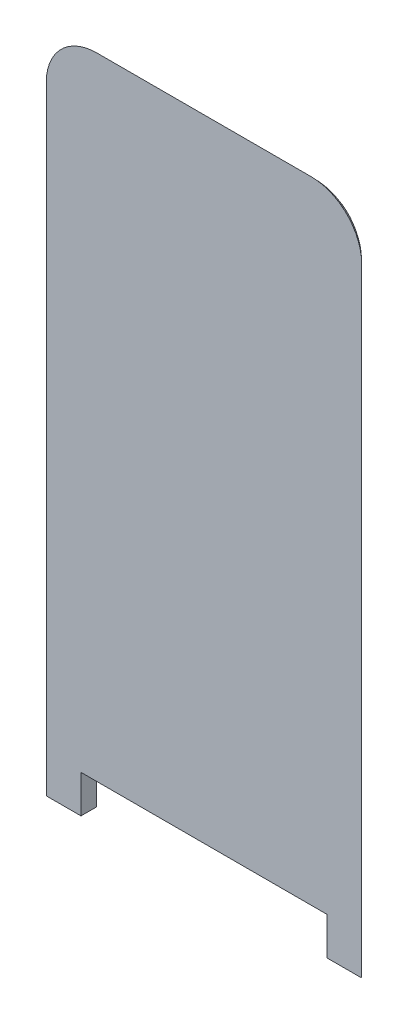
ISO-10303-21;
HEADER;
FILE_DESCRIPTION(('STEP AP214'),'2;1');
FILE_NAME('part.step','',(''),(''),'','','');
FILE_SCHEMA(('AUTOMOTIVE_DESIGN { 1 0 10303 214 1 1 1 1 }'));
ENDSEC;
DATA;
#1=APPLICATION_CONTEXT('core data for automotive mechanical design processes');
#2=APPLICATION_PROTOCOL_DEFINITION('international standard','automotive_design',2000,#1);
#3=PRODUCT_CONTEXT('',#1,'mechanical');
#4=PRODUCT('Part','Part','',(#3));
#5=PRODUCT_RELATED_PRODUCT_CATEGORY('part','',(#4));
#6=PRODUCT_DEFINITION_FORMATION('','',#4);
#7=PRODUCT_DEFINITION_CONTEXT('part definition',#1,'design');
#8=PRODUCT_DEFINITION('design','',#6,#7);
#9=PRODUCT_DEFINITION_SHAPE('','',#8);
#10=(LENGTH_UNIT() NAMED_UNIT(*) SI_UNIT(.MILLI.,.METRE.));
#11=(NAMED_UNIT(*) PLANE_ANGLE_UNIT() SI_UNIT($,.RADIAN.));
#12=(NAMED_UNIT(*) SI_UNIT($,.STERADIAN.) SOLID_ANGLE_UNIT());
#13=UNCERTAINTY_MEASURE_WITH_UNIT(LENGTH_MEASURE(1.E-05),#10,'distance_accuracy_value','');
#14=(GEOMETRIC_REPRESENTATION_CONTEXT(3) GLOBAL_UNCERTAINTY_ASSIGNED_CONTEXT((#13)) GLOBAL_UNIT_ASSIGNED_CONTEXT((#10,
#11,#12)) REPRESENTATION_CONTEXT('',''));
#15=CARTESIAN_POINT('',(0.,0.,0.));
#16=DIRECTION('',(0.,0.,1.));
#17=DIRECTION('',(1.,0.,0.));
#18=AXIS2_PLACEMENT_3D('',#15,#16,#17);
#19=CARTESIAN_POINT('',(-25.,-53.,2.5));
#20=DIRECTION('',(0.,1.,0.));
#21=DIRECTION('',(0.,0.,1.));
#22=AXIS2_PLACEMENT_3D('',#19,#20,#21);
#23=PLANE('',#22);
#24=DIRECTION('',(1.,0.,0.));
#25=VECTOR('',#24,1.);
#26=CARTESIAN_POINT('',(-25.,-53.,2.5));
#27=LINE('',#26,#25);
#28=CARTESIAN_POINT('',(-25.,-53.,2.5));
#29=VERTEX_POINT('',#28);
#30=CARTESIAN_POINT('',(-19.5,-53.,2.5));
#31=VERTEX_POINT('',#30);
#32=EDGE_CURVE('E129',#29,#31,#27,.T.);
#33=ORIENTED_EDGE('',*,*,#32,.F.);
#34=CARTESIAN_POINT('',(-19.1905249806889,-53.,8.));
#35=DIRECTION('',(0.,1.,0.));
#36=DIRECTION('',(0.,0.,1.));
#37=AXIS2_PLACEMENT_3D('',#34,#35,#36);
#38=CIRCLE('',#37,8.);
#39=CARTESIAN_POINT('',(-19.5,-53.,0.00598816535637287));
#40=VERTEX_POINT('',#39);
#41=EDGE_CURVE('E114',#29,#40,#38,.F.);
#42=ORIENTED_EDGE('',*,*,#41,.T.);
#43=DIRECTION('',(0.,0.,-1.));
#44=VECTOR('',#43,1.);
#45=CARTESIAN_POINT('',(-19.5,-53.,2.5));
#46=LINE('',#45,#44);
#47=EDGE_CURVE('E135',#31,#40,#46,.T.);
#48=ORIENTED_EDGE('',*,*,#47,.F.);
#49=EDGE_LOOP('',(#33,#42,#48));
#50=FACE_BOUND('',#49,.T.);
#51=ADVANCED_FACE('F34',(#50),#23,.F.);
#52=CARTESIAN_POINT('',(-19.5,-53.,2.5));
#53=DIRECTION('',(-1.,0.,0.));
#54=DIRECTION('',(0.,0.,1.));
#55=AXIS2_PLACEMENT_3D('',#52,#53,#54);
#56=PLANE('',#55);
#57=ORIENTED_EDGE('',*,*,#47,.T.);
#58=DIRECTION('',(0.,-1.,0.));
#59=VECTOR('',#58,1.);
#60=CARTESIAN_POINT('',(-19.5,-53.,0.00598816535637287));
#61=LINE('',#60,#59);
#62=CARTESIAN_POINT('',(-19.5,-47.017253965727,0.00598816535637287));
#63=VERTEX_POINT('',#62);
#64=EDGE_CURVE('E120',#40,#63,#61,.F.);
#65=ORIENTED_EDGE('',*,*,#64,.T.);
#66=DIRECTION('',(0.,0.,-1.));
#67=VECTOR('',#66,1.);
#68=CARTESIAN_POINT('',(-19.5,-47.017253965727,2.5));
#69=LINE('',#68,#67);
#70=CARTESIAN_POINT('',(-19.5,-47.017253965727,2.5));
#71=VERTEX_POINT('',#70);
#72=EDGE_CURVE('E157',#71,#63,#69,.T.);
#73=ORIENTED_EDGE('',*,*,#72,.F.);
#74=DIRECTION('',(0.,1.,0.));
#75=VECTOR('',#74,1.);
#76=CARTESIAN_POINT('',(-19.5,-53.,2.5));
#77=LINE('',#76,#75);
#78=EDGE_CURVE('E137',#31,#71,#77,.T.);
#79=ORIENTED_EDGE('',*,*,#78,.F.);
#80=EDGE_LOOP('',(#57,#65,#73,#79));
#81=FACE_BOUND('',#80,.T.);
#82=ADVANCED_FACE('F216',(#81),#56,.F.);
#83=CARTESIAN_POINT('',(-19.5,-47.017253965727,2.5));
#84=DIRECTION('',(0.,1.,0.));
#85=DIRECTION('',(0.,0.,1.));
#86=AXIS2_PLACEMENT_3D('',#83,#84,#85);
#87=PLANE('',#86);
#88=ORIENTED_EDGE('',*,*,#72,.T.);
#89=CARTESIAN_POINT('',(-19.1905249806889,-47.017253965727,8.));
#90=DIRECTION('',(0.,1.,0.));
#91=DIRECTION('',(0.,0.,1.));
#92=AXIS2_PLACEMENT_3D('',#89,#90,#91);
#93=CIRCLE('',#92,8.);
#94=CARTESIAN_POINT('',(-19.1905249806889,-47.017253965727,0.));
#95=VERTEX_POINT('',#94);
#96=EDGE_CURVE('E166',#63,#95,#93,.F.);
#97=ORIENTED_EDGE('',*,*,#96,.T.);
#98=DIRECTION('',(1.,0.,0.));
#99=VECTOR('',#98,1.);
#100=CARTESIAN_POINT('',(-19.5,-47.017253965727,0.));
#101=LINE('',#100,#99);
#102=CARTESIAN_POINT('',(19.1905249806889,-47.017253965727,0.));
#103=VERTEX_POINT('',#102);
#104=EDGE_CURVE('E150',#95,#103,#101,.T.);
#105=ORIENTED_EDGE('',*,*,#104,.T.);
#106=CARTESIAN_POINT('',(19.1905249806889,-47.017253965727,8.));
#107=DIRECTION('',(0.,1.,0.));
#108=DIRECTION('',(0.,0.,1.));
#109=AXIS2_PLACEMENT_3D('',#106,#107,#108);
#110=CIRCLE('',#109,8.);
#111=CARTESIAN_POINT('',(19.5,-47.017253965727,0.00598816535637287));
#112=VERTEX_POINT('',#111);
#113=EDGE_CURVE('E164',#103,#112,#110,.F.);
#114=ORIENTED_EDGE('',*,*,#113,.T.);
#115=DIRECTION('',(0.,0.,-1.));
#116=VECTOR('',#115,1.);
#117=CARTESIAN_POINT('',(19.5,-47.017253965727,2.5));
#118=LINE('',#117,#116);
#119=CARTESIAN_POINT('',(19.5,-47.017253965727,2.5));
#120=VERTEX_POINT('',#119);
#121=EDGE_CURVE('E155',#120,#112,#118,.T.);
#122=ORIENTED_EDGE('',*,*,#121,.F.);
#123=DIRECTION('',(1.,0.,0.));
#124=VECTOR('',#123,1.);
#125=CARTESIAN_POINT('',(-19.5,-47.017253965727,2.5));
#126=LINE('',#125,#124);
#127=EDGE_CURVE('E139',#71,#120,#126,.T.);
#128=ORIENTED_EDGE('',*,*,#127,.F.);
#129=EDGE_LOOP('',(#88,#97,#105,#114,#122,#128));
#130=FACE_BOUND('',#129,.T.);
#131=ADVANCED_FACE('F201',(#130),#87,.F.);
#132=CARTESIAN_POINT('',(19.5,-53.,2.5));
#133=DIRECTION('',(1.,0.,0.));
#134=DIRECTION('',(0.,0.,-1.));
#135=AXIS2_PLACEMENT_3D('',#132,#133,#134);
#136=PLANE('',#135);
#137=ORIENTED_EDGE('',*,*,#121,.T.);
#138=DIRECTION('',(0.,1.,0.));
#139=VECTOR('',#138,1.);
#140=CARTESIAN_POINT('',(19.5,-47.017253965727,0.00598816535637287));
#141=LINE('',#140,#139);
#142=CARTESIAN_POINT('',(19.5,-53.,0.00598816535637287));
#143=VERTEX_POINT('',#142);
#144=EDGE_CURVE('E43',#112,#143,#141,.F.);
#145=ORIENTED_EDGE('',*,*,#144,.T.);
#146=DIRECTION('',(0.,0.,-1.));
#147=VECTOR('',#146,1.);
#148=CARTESIAN_POINT('',(19.5,-53.,2.5));
#149=LINE('',#148,#147);
#150=CARTESIAN_POINT('',(19.5,-53.,2.5));
#151=VERTEX_POINT('',#150);
#152=EDGE_CURVE('E149',#151,#143,#149,.T.);
#153=ORIENTED_EDGE('',*,*,#152,.F.);
#154=DIRECTION('',(0.,-1.,0.));
#155=VECTOR('',#154,1.);
#156=CARTESIAN_POINT('',(19.5,-53.,2.5));
#157=LINE('',#156,#155);
#158=EDGE_CURVE('E144',#120,#151,#157,.T.);
#159=ORIENTED_EDGE('',*,*,#158,.F.);
#160=EDGE_LOOP('',(#137,#145,#153,#159));
#161=FACE_BOUND('',#160,.T.);
#162=ADVANCED_FACE('F214',(#161),#136,.F.);
#163=CARTESIAN_POINT('',(19.5,-53.,2.5));
#164=DIRECTION('',(0.,1.,0.));
#165=DIRECTION('',(0.,0.,1.));
#166=AXIS2_PLACEMENT_3D('',#163,#164,#165);
#167=PLANE('',#166);
#168=ORIENTED_EDGE('',*,*,#152,.T.);
#169=CARTESIAN_POINT('',(19.1905249806889,-53.,8.));
#170=DIRECTION('',(0.,1.,0.));
#171=DIRECTION('',(0.,0.,1.));
#172=AXIS2_PLACEMENT_3D('',#169,#170,#171);
#173=CIRCLE('',#172,8.);
#174=CARTESIAN_POINT('',(25.,-53.,2.5));
#175=VERTEX_POINT('',#174);
#176=EDGE_CURVE('E11',#143,#175,#173,.F.);
#177=ORIENTED_EDGE('',*,*,#176,.T.);
#178=DIRECTION('',(1.,0.,0.));
#179=VECTOR('',#178,1.);
#180=CARTESIAN_POINT('',(19.5,-53.,2.5));
#181=LINE('',#180,#179);
#182=EDGE_CURVE('E146',#151,#175,#181,.T.);
#183=ORIENTED_EDGE('',*,*,#182,.F.);
#184=EDGE_LOOP('',(#168,#177,#183));
#185=FACE_BOUND('',#184,.T.);
#186=ADVANCED_FACE('F213',(#185),#167,.F.);
#187=CARTESIAN_POINT('',(0.,0.,2.5));
#188=DIRECTION('',(0.,0.,1.));
#189=DIRECTION('',(1.,0.,0.));
#190=AXIS2_PLACEMENT_3D('',#187,#188,#189);
#191=PLANE('',#190);
#192=DIRECTION('',(0.,1.,0.));
#193=VECTOR('',#192,1.);
#194=CARTESIAN_POINT('',(25.,53.,2.5));
#195=LINE('',#194,#193);
#196=CARTESIAN_POINT('',(25.,45.,2.5));
#197=VERTEX_POINT('',#196);
#198=EDGE_CURVE('E153',#175,#197,#195,.T.);
#199=ORIENTED_EDGE('',*,*,#198,.T.);
#200=CARTESIAN_POINT('',(17.,45.,2.5));
#201=DIRECTION('',(0.,0.,1.));
#202=DIRECTION('',(1.,0.,0.));
#203=AXIS2_PLACEMENT_3D('',#200,#201,#202);
#204=CIRCLE('',#203,8.);
#205=CARTESIAN_POINT('',(17.,53.,2.5));
#206=VERTEX_POINT('',#205);
#207=EDGE_CURVE('E125',#197,#206,#204,.T.);
#208=ORIENTED_EDGE('',*,*,#207,.T.);
#209=DIRECTION('',(-1.,0.,0.));
#210=VECTOR('',#209,1.);
#211=CARTESIAN_POINT('',(-25.,53.,2.5));
#212=LINE('',#211,#210);
#213=CARTESIAN_POINT('',(-17.,53.,2.5));
#214=VERTEX_POINT('',#213);
#215=EDGE_CURVE('E133',#206,#214,#212,.T.);
#216=ORIENTED_EDGE('',*,*,#215,.T.);
#217=CARTESIAN_POINT('',(-17.,45.,2.5));
#218=DIRECTION('',(0.,0.,1.));
#219=DIRECTION('',(1.,0.,0.));
#220=AXIS2_PLACEMENT_3D('',#217,#218,#219);
#221=CIRCLE('',#220,8.);
#222=CARTESIAN_POINT('',(-25.,45.,2.5));
#223=VERTEX_POINT('',#222);
#224=EDGE_CURVE('E131',#214,#223,#221,.T.);
#225=ORIENTED_EDGE('',*,*,#224,.T.);
#226=DIRECTION('',(0.,-1.,0.));
#227=VECTOR('',#226,1.);
#228=CARTESIAN_POINT('',(-25.,53.,2.5));
#229=LINE('',#228,#227);
#230=EDGE_CURVE('E118',#223,#29,#229,.T.);
#231=ORIENTED_EDGE('',*,*,#230,.T.);
#232=ORIENTED_EDGE('',*,*,#32,.T.);
#233=ORIENTED_EDGE('',*,*,#78,.T.);
#234=ORIENTED_EDGE('',*,*,#127,.T.);
#235=ORIENTED_EDGE('',*,*,#158,.T.);
#236=ORIENTED_EDGE('',*,*,#182,.T.);
#237=EDGE_LOOP('',(#199,#208,#216,#225,#231,#232,#233,#234,#235,#236));
#238=FACE_BOUND('',#237,.T.);
#239=ADVANCED_FACE('F128',(#238),#191,.T.);
#240=CARTESIAN_POINT('',(0.,0.,0.));
#241=DIRECTION('',(0.,0.,1.));
#242=DIRECTION('',(1.,0.,0.));
#243=AXIS2_PLACEMENT_3D('',#240,#241,#242);
#244=PLANE('',#243);
#245=ORIENTED_EDGE('',*,*,#104,.F.);
#246=DIRECTION('',(0.,-1.,0.));
#247=VECTOR('',#246,1.);
#248=CARTESIAN_POINT('',(-19.1905249806889,0.,0.));
#249=LINE('',#248,#247);
#250=CARTESIAN_POINT('',(-19.1905249806889,45.,0.));
#251=VERTEX_POINT('',#250);
#252=EDGE_CURVE('E58',#95,#251,#249,.F.);
#253=ORIENTED_EDGE('',*,*,#252,.T.);
#254=CARTESIAN_POINT('',(-17.,45.,0.));
#255=DIRECTION('',(0.,0.,1.));
#256=DIRECTION('',(1.,0.,0.));
#257=AXIS2_PLACEMENT_3D('',#254,#255,#256);
#258=CIRCLE('',#257,2.19052498068887);
#259=CARTESIAN_POINT('',(-17.,47.1905249806889,0.));
#260=VERTEX_POINT('',#259);
#261=EDGE_CURVE('E174',#251,#260,#258,.F.);
#262=ORIENTED_EDGE('',*,*,#261,.T.);
#263=DIRECTION('',(-1.,0.,0.));
#264=VECTOR('',#263,1.);
#265=CARTESIAN_POINT('',(0.,47.1905249806889,0.));
#266=LINE('',#265,#264);
#267=CARTESIAN_POINT('',(17.,47.1905249806889,0.));
#268=VERTEX_POINT('',#267);
#269=EDGE_CURVE('E172',#260,#268,#266,.F.);
#270=ORIENTED_EDGE('',*,*,#269,.T.);
#271=CARTESIAN_POINT('',(17.,45.,0.));
#272=DIRECTION('',(0.,0.,1.));
#273=DIRECTION('',(1.,0.,0.));
#274=AXIS2_PLACEMENT_3D('',#271,#272,#273);
#275=CIRCLE('',#274,2.19052498068887);
#276=CARTESIAN_POINT('',(19.1905249806889,45.,0.));
#277=VERTEX_POINT('',#276);
#278=EDGE_CURVE('E170',#268,#277,#275,.F.);
#279=ORIENTED_EDGE('',*,*,#278,.T.);
#280=DIRECTION('',(0.,1.,0.));
#281=VECTOR('',#280,1.);
#282=CARTESIAN_POINT('',(19.1905249806889,0.,0.));
#283=LINE('',#282,#281);
#284=EDGE_CURVE('E168',#277,#103,#283,.F.);
#285=ORIENTED_EDGE('',*,*,#284,.T.);
#286=EDGE_LOOP('',(#245,#253,#262,#270,#279,#285));
#287=FACE_BOUND('',#286,.T.);
#288=ADVANCED_FACE('F199',(#287),#244,.F.);
#289=CARTESIAN_POINT('',(19.1905249806889,53.,8.));
#290=DIRECTION('',(0.,1.,0.));
#291=DIRECTION('',(-1.,0.,0.));
#292=AXIS2_PLACEMENT_3D('',#289,#290,#291);
#293=CYLINDRICAL_SURFACE('',#292,8.);
#294=ORIENTED_EDGE('',*,*,#113,.F.);
#295=ORIENTED_EDGE('',*,*,#284,.F.);
#296=CARTESIAN_POINT('',(19.1905249806889,45.,8.));
#297=DIRECTION('',(0.,1.,0.));
#298=DIRECTION('',(0.,0.,1.));
#299=AXIS2_PLACEMENT_3D('',#296,#297,#298);
#300=CIRCLE('',#299,8.);
#301=EDGE_CURVE('E38',#197,#277,#300,.T.);
#302=ORIENTED_EDGE('',*,*,#301,.F.);
#303=ORIENTED_EDGE('',*,*,#198,.F.);
#304=ORIENTED_EDGE('',*,*,#176,.F.);
#305=ORIENTED_EDGE('',*,*,#144,.F.);
#306=EDGE_LOOP('',(#294,#295,#302,#303,#304,#305));
#307=FACE_BOUND('',#306,.T.);
#308=ADVANCED_FACE('F36',(#307),#293,.T.);
#309=CARTESIAN_POINT('',(17.,45.,8.));
#310=DIRECTION('',(0.,0.,-1.));
#311=DIRECTION('',(-1.,0.,0.));
#312=AXIS2_PLACEMENT_3D('',#309,#310,#311);
#313=DEGENERATE_TOROIDAL_SURFACE('',#312,2.19052498068887,8.,.T.);
#314=ORIENTED_EDGE('',*,*,#301,.T.);
#315=ORIENTED_EDGE('',*,*,#278,.F.);
#316=CARTESIAN_POINT('',(17.,47.1905249806889,8.));
#317=DIRECTION('',(-1.,0.,0.));
#318=DIRECTION('',(0.,0.,1.));
#319=AXIS2_PLACEMENT_3D('',#316,#317,#318);
#320=CIRCLE('',#319,8.);
#321=EDGE_CURVE('E182',#206,#268,#320,.T.);
#322=ORIENTED_EDGE('',*,*,#321,.F.);
#323=ORIENTED_EDGE('',*,*,#207,.F.);
#324=EDGE_LOOP('',(#314,#315,#322,#323));
#325=FACE_BOUND('',#324,.T.);
#326=ADVANCED_FACE('F193',(#325),#313,.T.);
#327=CARTESIAN_POINT('',(-25.,47.1905249806889,8.));
#328=DIRECTION('',(-1.,0.,0.));
#329=DIRECTION('',(0.,0.,1.));
#330=AXIS2_PLACEMENT_3D('',#327,#328,#329);
#331=CYLINDRICAL_SURFACE('',#330,8.);
#332=ORIENTED_EDGE('',*,*,#321,.T.);
#333=ORIENTED_EDGE('',*,*,#269,.F.);
#334=CARTESIAN_POINT('',(-17.,47.1905249806889,8.));
#335=DIRECTION('',(-1.,0.,0.));
#336=DIRECTION('',(0.,0.,1.));
#337=AXIS2_PLACEMENT_3D('',#334,#335,#336);
#338=CIRCLE('',#337,8.);
#339=EDGE_CURVE('E180',#214,#260,#338,.T.);
#340=ORIENTED_EDGE('',*,*,#339,.F.);
#341=ORIENTED_EDGE('',*,*,#215,.F.);
#342=EDGE_LOOP('',(#332,#333,#340,#341));
#343=FACE_BOUND('',#342,.T.);
#344=ADVANCED_FACE('F208',(#343),#331,.T.);
#345=CARTESIAN_POINT('',(-17.,45.,8.));
#346=DIRECTION('',(0.,0.,-1.));
#347=DIRECTION('',(-1.,0.,0.));
#348=AXIS2_PLACEMENT_3D('',#345,#346,#347);
#349=DEGENERATE_TOROIDAL_SURFACE('',#348,2.19052498068887,8.,.T.);
#350=ORIENTED_EDGE('',*,*,#339,.T.);
#351=ORIENTED_EDGE('',*,*,#261,.F.);
#352=CARTESIAN_POINT('',(-19.1905249806889,45.,8.));
#353=DIRECTION('',(0.,-1.,0.));
#354=DIRECTION('',(0.,0.,-1.));
#355=AXIS2_PLACEMENT_3D('',#352,#353,#354);
#356=CIRCLE('',#355,8.);
#357=EDGE_CURVE('E178',#223,#251,#356,.T.);
#358=ORIENTED_EDGE('',*,*,#357,.F.);
#359=ORIENTED_EDGE('',*,*,#224,.F.);
#360=EDGE_LOOP('',(#350,#351,#358,#359));
#361=FACE_BOUND('',#360,.T.);
#362=ADVANCED_FACE('F206',(#361),#349,.T.);
#363=CARTESIAN_POINT('',(-19.1905249806889,53.,8.));
#364=DIRECTION('',(0.,-1.,0.));
#365=DIRECTION('',(1.,0.,0.));
#366=AXIS2_PLACEMENT_3D('',#363,#364,#365);
#367=CYLINDRICAL_SURFACE('',#366,8.);
#368=ORIENTED_EDGE('',*,*,#357,.T.);
#369=ORIENTED_EDGE('',*,*,#252,.F.);
#370=ORIENTED_EDGE('',*,*,#96,.F.);
#371=ORIENTED_EDGE('',*,*,#64,.F.);
#372=ORIENTED_EDGE('',*,*,#41,.F.);
#373=ORIENTED_EDGE('',*,*,#230,.F.);
#374=EDGE_LOOP('',(#368,#369,#370,#371,#372,#373));
#375=FACE_BOUND('',#374,.T.);
#376=ADVANCED_FACE('F117',(#375),#367,.T.);
#377=CLOSED_SHELL('',(#51,#82,#131,#162,#186,#239,#288,#308,#326,#344,#362,#376));
#378=MANIFOLD_SOLID_BREP('B2',#377);
#379=ADVANCED_BREP_SHAPE_REPRESENTATION('',(#18,#378),#14);
#380=SHAPE_DEFINITION_REPRESENTATION(#9,#379);
ENDSEC;
END-ISO-10303-21;
